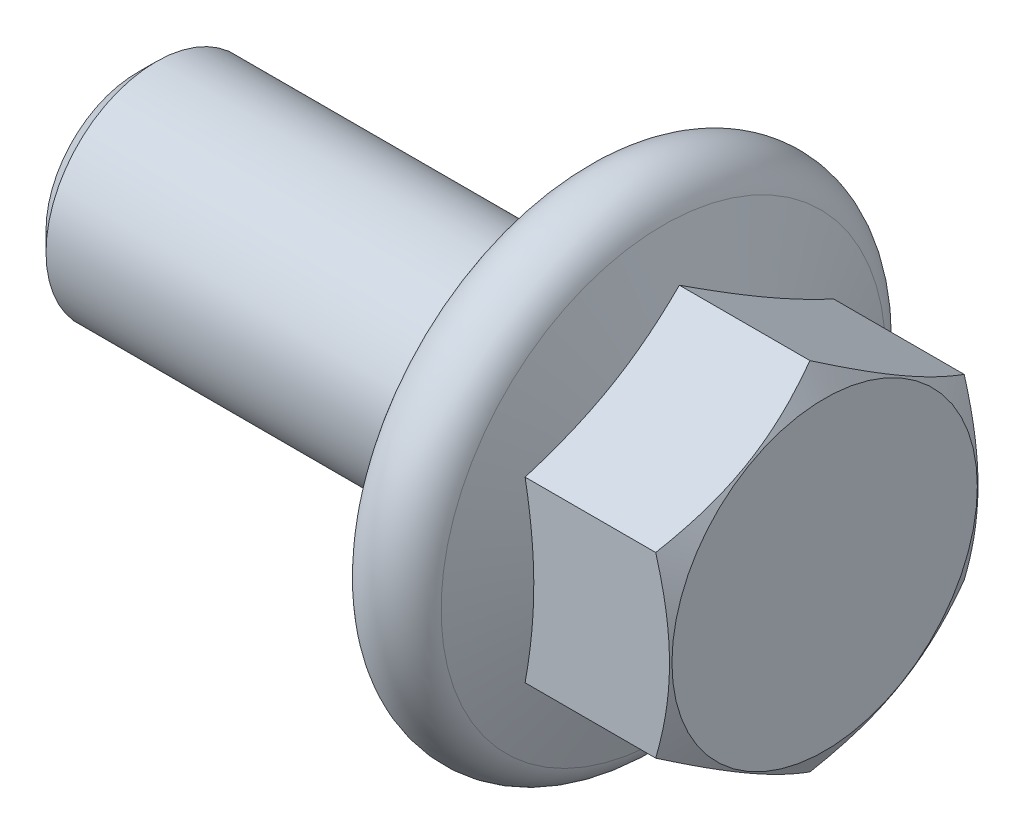
ISO-10303-21;
HEADER;
FILE_DESCRIPTION(('STEP AP214'),'2;1');
FILE_NAME('part.step','',(''),(''),'','','');
FILE_SCHEMA(('AUTOMOTIVE_DESIGN { 1 0 10303 214 1 1 1 1 }'));
ENDSEC;
DATA;
#1=APPLICATION_CONTEXT('core data for automotive mechanical design processes');
#2=APPLICATION_PROTOCOL_DEFINITION('international standard','automotive_design',2000,#1);
#3=PRODUCT_CONTEXT('',#1,'mechanical');
#4=PRODUCT('Part','Part','',(#3));
#5=PRODUCT_RELATED_PRODUCT_CATEGORY('part','',(#4));
#6=PRODUCT_DEFINITION_FORMATION('','',#4);
#7=PRODUCT_DEFINITION_CONTEXT('part definition',#1,'design');
#8=PRODUCT_DEFINITION('design','',#6,#7);
#9=PRODUCT_DEFINITION_SHAPE('','',#8);
#10=(LENGTH_UNIT() NAMED_UNIT(*) SI_UNIT(.MILLI.,.METRE.));
#11=(NAMED_UNIT(*) PLANE_ANGLE_UNIT() SI_UNIT($,.RADIAN.));
#12=(NAMED_UNIT(*) SI_UNIT($,.STERADIAN.) SOLID_ANGLE_UNIT());
#13=UNCERTAINTY_MEASURE_WITH_UNIT(LENGTH_MEASURE(1.E-05),#10,'distance_accuracy_value','');
#14=(GEOMETRIC_REPRESENTATION_CONTEXT(3) GLOBAL_UNCERTAINTY_ASSIGNED_CONTEXT((#13)) GLOBAL_UNIT_ASSIGNED_CONTEXT((#10,
#11,#12)) REPRESENTATION_CONTEXT('',''));
#15=CARTESIAN_POINT('',(0.,0.,0.));
#16=DIRECTION('',(0.,0.,1.));
#17=DIRECTION('',(1.,0.,0.));
#18=AXIS2_PLACEMENT_3D('',#15,#16,#17);
#19=CARTESIAN_POINT('',(286.686841982649,231.732577862447,52.2039636461074));
#20=DIRECTION('',(0.,-0.866025403784439,0.5));
#21=DIRECTION('',(0.,0.5,0.866025403784439));
#22=AXIS2_PLACEMENT_3D('',#19,#20,#21);
#23=PLANE('',#22);
#24=CARTESIAN_POINT('',(285.690711667062,230.722214891365,50.4539636461074));
#25=CARTESIAN_POINT('',(285.721179702552,230.805897607923,50.5989063629015));
#26=CARTESIAN_POINT('',(285.748895550176,230.889856256773,50.7443270084434));
#27=CARTESIAN_POINT('',(285.797657168736,231.05831941052,51.0361137499378));
#28=CARTESIAN_POINT('',(285.818697721353,231.142824290032,51.1824804947389));
#29=CARTESIAN_POINT('',(285.852730166642,231.311442186911,51.4745352591997));
#30=CARTESIAN_POINT('',(285.865796282362,231.395551354232,51.6202166103807));
#31=CARTESIAN_POINT('',(285.883321603825,231.563966358921,51.9119199552606));
#32=CARTESIAN_POINT('',(285.887784036244,231.648272110684,52.057941800684));
#33=CARTESIAN_POINT('',(285.887784036244,231.81688361421,52.3499854915308));
#34=CARTESIAN_POINT('',(285.883321603825,231.901189365972,52.4960073369542));
#35=CARTESIAN_POINT('',(285.865796282362,232.069604370662,52.7877106818342));
#36=CARTESIAN_POINT('',(285.852730166642,232.153713537983,52.9333920330151));
#37=CARTESIAN_POINT('',(285.818697721353,232.322331434862,53.225446797476));
#38=CARTESIAN_POINT('',(285.797657168736,232.406836314374,53.371813542277));
#39=CARTESIAN_POINT('',(285.748895550176,232.575299468121,53.6636002837714));
#40=CARTESIAN_POINT('',(285.721179702552,232.659258116971,53.8090209293133));
#41=CARTESIAN_POINT('',(285.690711667062,232.742940833529,53.9539636461074));
#42=B_SPLINE_CURVE_WITH_KNOTS('',3,(#24,#25,#26,#27,#28,#29,#30,#31,#32,#33,#34,#35,#36,#37,#38,
#39,#40,#41),.UNSPECIFIED.,.F.,.F.,(4,2,2,2,2,2,2,2,4),(0.,0.510400948319163,1.02119991788172,
1.52716902069208,2.03294833077723,2.53872764086239,3.04469674367274,3.55549571323531,
4.06589666155448),.UNSPECIFIED.);
#43=CARTESIAN_POINT('',(285.690711667062,230.722214891365,50.4539636461074));
#44=VERTEX_POINT('',#43);
#45=CARTESIAN_POINT('',(285.690711667062,232.742940833529,53.9539636461074));
#46=VERTEX_POINT('',#45);
#47=EDGE_CURVE('E41',#44,#46,#42,.T.);
#48=ORIENTED_EDGE('',*,*,#47,.F.);
#49=DIRECTION('',(1.,0.,0.));
#50=VECTOR('',#49,1.);
#51=CARTESIAN_POINT('',(284.386841982649,230.722214891365,50.4539636461074));
#52=LINE('',#51,#50);
#53=CARTESIAN_POINT('',(288.654027332057,230.722214891365,50.4539636461074));
#54=VERTEX_POINT('',#53);
#55=EDGE_CURVE('E11',#44,#54,#52,.T.);
#56=ORIENTED_EDGE('',*,*,#55,.T.);
#57=CARTESIAN_POINT('',(288.654027332057,230.722214891365,50.4539636461075));
#58=CARTESIAN_POINT('',(288.705310128086,230.811013558565,50.6077674493428));
#59=CARTESIAN_POINT('',(288.751949147132,230.900578734598,50.7628988848196));
#60=CARTESIAN_POINT('',(288.833356154107,231.081259847774,51.0758477528082));
#61=CARTESIAN_POINT('',(288.868095346466,231.172378994226,51.2336707440056));
#62=CARTESIAN_POINT('',(288.922169403902,231.353488093225,51.5473609051856));
#63=CARTESIAN_POINT('',(288.941864203763,231.443450187622,51.7031798234364));
#64=CARTESIAN_POINT('',(288.965371287829,231.623797456949,52.0155504569161));
#65=CARTESIAN_POINT('',(288.969203042603,231.714181976815,52.1721010375419));
#66=CARTESIAN_POINT('',(288.961211324287,231.883055755967,52.4645990030996));
#67=CARTESIAN_POINT('',(288.951350082929,231.961570356139,52.6005902797343));
#68=CARTESIAN_POINT('',(288.920102055801,232.118088059475,52.8716868941958));
#69=CARTESIAN_POINT('',(288.898704606212,232.196090621689,53.0067912950718));
#70=CARTESIAN_POINT('',(288.845215123715,232.352930766255,53.2784463941255));
#71=CARTESIAN_POINT('',(288.812896458175,232.431748508383,53.4149627280287));
#72=CARTESIAN_POINT('',(288.739546750589,232.588208766017,53.6859598436161));
#73=CARTESIAN_POINT('',(288.698532931741,232.665853284413,53.8204440944082));
#74=CARTESIAN_POINT('',(288.654027332057,232.742940833529,53.9539636461074));
#75=B_SPLINE_CURVE_WITH_KNOTS('',3,(#57,#58,#59,#60,#61,#62,#63,#64,#65,#66,#67,#68,#69,#70,#71,
#72,#73,#74),.UNSPECIFIED.,.F.,.F.,(4,2,2,2,2,2,2,2,4),(0.,0.554778020224562,1.11088917979757,
1.65323831076781,2.19492155557146,2.66648861960603,3.13849233914036,3.62096283935527,
4.10248645365122),.UNSPECIFIED.);
#76=CARTESIAN_POINT('',(288.654027332057,232.742940833529,53.9539636461074));
#77=VERTEX_POINT('',#76);
#78=EDGE_CURVE('E33',#54,#77,#75,.T.);
#79=ORIENTED_EDGE('',*,*,#78,.T.);
#80=DIRECTION('',(1.,0.,0.));
#81=VECTOR('',#80,1.);
#82=CARTESIAN_POINT('',(284.386841982649,232.742940833529,53.9539636461074));
#83=LINE('',#82,#81);
#84=EDGE_CURVE('E148',#46,#77,#83,.T.);
#85=ORIENTED_EDGE('',*,*,#84,.F.);
#86=EDGE_LOOP('',(#48,#56,#79,#85));
#87=FACE_BOUND('',#86,.T.);
#88=ADVANCED_FACE('F17',(#87),#23,.T.);
#89=CARTESIAN_POINT('',(286.686841982649,234.763666775693,53.9539636461074));
#90=DIRECTION('',(0.,0.,1.));
#91=DIRECTION('',(0.,1.,0.));
#92=AXIS2_PLACEMENT_3D('',#89,#90,#91);
#93=PLANE('',#92);
#94=CARTESIAN_POINT('',(285.690711667062,232.742940833529,53.9539636461074));
#95=CARTESIAN_POINT('',(285.721179702552,232.910306266645,53.9539636461074));
#96=CARTESIAN_POINT('',(285.748895550176,233.078223564344,53.9539636461074));
#97=CARTESIAN_POINT('',(285.797657168736,233.415149871839,53.9539636461074));
#98=CARTESIAN_POINT('',(285.818697721353,233.584159630862,53.9539636461074));
#99=CARTESIAN_POINT('',(285.852730166642,233.921395424621,53.9539636461074));
#100=CARTESIAN_POINT('',(285.865796282362,234.089613759262,53.9539636461074));
#101=CARTESIAN_POINT('',(285.883321603825,234.426443768641,53.9539636461074));
#102=CARTESIAN_POINT('',(285.887784036244,234.595055272167,53.9539636461074));
#103=CARTESIAN_POINT('',(285.887784036244,234.932278279218,53.9539636461074));
#104=CARTESIAN_POINT('',(285.883321603825,235.100889782743,53.9539636461074));
#105=CARTESIAN_POINT('',(285.865796282363,235.437719792123,53.9539636461074));
#106=CARTESIAN_POINT('',(285.852730166642,235.605938126764,53.9539636461074));
#107=CARTESIAN_POINT('',(285.818697721354,235.943173920523,53.9539636461074));
#108=CARTESIAN_POINT('',(285.797657168736,236.112183679545,53.9539636461074));
#109=CARTESIAN_POINT('',(285.748895550176,236.449109987041,53.9539636461074));
#110=CARTESIAN_POINT('',(285.721179702552,236.61702728474,53.9539636461074));
#111=CARTESIAN_POINT('',(285.690711667062,236.784392717856,53.9539636461074));
#112=B_SPLINE_CURVE_WITH_KNOTS('',3,(#94,#95,#96,#97,#98,#99,#100,#101,#102,#103,#104,#105,#106,
#107,#108,#109,#110,#111),.UNSPECIFIED.,.F.,.F.,(4,2,2,2,2,2,2,2,4),(0.,0.51040094831911,
1.02119991788162,1.52716902069191,2.03294833077698,2.53872764086208,3.04469674367234,
3.55549571323487,4.06589666155401),.UNSPECIFIED.);
#113=CARTESIAN_POINT('',(285.690711667062,236.784392717856,53.9539636461074));
#114=VERTEX_POINT('',#113);
#115=EDGE_CURVE('E255',#46,#114,#112,.T.);
#116=ORIENTED_EDGE('',*,*,#115,.F.);
#117=ORIENTED_EDGE('',*,*,#84,.T.);
#118=CARTESIAN_POINT('',(288.654027332057,232.742940833529,53.9539636461074));
#119=CARTESIAN_POINT('',(288.705310128086,232.92053816793,53.9539636461074));
#120=CARTESIAN_POINT('',(288.751949147132,233.099668519994,53.9539636461074));
#121=CARTESIAN_POINT('',(288.833356154107,233.461030746346,53.9539636461074));
#122=CARTESIAN_POINT('',(288.868095346466,233.64326903925,53.9539636461074));
#123=CARTESIAN_POINT('',(288.922169403902,234.005487237249,53.9539636461074));
#124=CARTESIAN_POINT('',(288.941864203763,234.185411426043,53.9539636461074));
#125=CARTESIAN_POINT('',(288.965371287829,234.546105964696,53.9539636461074));
#126=CARTESIAN_POINT('',(288.969203042603,234.726875004428,53.9539636461074));
#127=CARTESIAN_POINT('',(288.961211324287,235.064622562732,53.9539636461074));
#128=CARTESIAN_POINT('',(288.951350082929,235.221651763077,53.9539636461074));
#129=CARTESIAN_POINT('',(288.920102055801,235.534687169748,53.9539636461074));
#130=CARTESIAN_POINT('',(288.898704606213,235.690692294177,53.9539636461074));
#131=CARTESIAN_POINT('',(288.845215123716,236.004372583308,53.9539636461074));
#132=CARTESIAN_POINT('',(288.812896458176,236.162008067564,53.9539636461074));
#133=CARTESIAN_POINT('',(288.739546750589,236.474928582832,53.9539636461074));
#134=CARTESIAN_POINT('',(288.698532931741,236.630217619625,53.9539636461074));
#135=CARTESIAN_POINT('',(288.654027332058,236.784392717856,53.9539636461074));
#136=B_SPLINE_CURVE_WITH_KNOTS('',3,(#118,#119,#120,#121,#122,#123,#124,#125,#126,#127,#128,
#129,#130,#131,#132,#133,#134,#135),.UNSPECIFIED.,.F.,.F.,(4,2,2,2,2,2,2,2,4),(0.,
0.554778020224548,1.11088917979758,1.6532383107678,2.1949215555714,2.66648861960589,
3.13849233914012,3.62096283935497,4.1024864536508),.UNSPECIFIED.);
#137=CARTESIAN_POINT('',(288.654027332058,236.784392717856,53.9539636461074));
#138=VERTEX_POINT('',#137);
#139=EDGE_CURVE('E150',#77,#138,#136,.T.);
#140=ORIENTED_EDGE('',*,*,#139,.T.);
#141=DIRECTION('',(1.,0.,0.));
#142=VECTOR('',#141,1.);
#143=CARTESIAN_POINT('',(284.386841982649,236.784392717856,53.9539636461074));
#144=LINE('',#143,#142);
#145=EDGE_CURVE('E159',#114,#138,#144,.T.);
#146=ORIENTED_EDGE('',*,*,#145,.F.);
#147=EDGE_LOOP('',(#116,#117,#140,#146));
#148=FACE_BOUND('',#147,.T.);
#149=ADVANCED_FACE('F260',(#148),#93,.T.);
#150=CARTESIAN_POINT('',(286.686841982649,237.794755688938,52.2039636461074));
#151=DIRECTION('',(0.,0.866025403784439,0.5));
#152=DIRECTION('',(0.,0.5,-0.866025403784439));
#153=AXIS2_PLACEMENT_3D('',#150,#151,#152);
#154=PLANE('',#153);
#155=CARTESIAN_POINT('',(285.690711667062,236.784392717856,53.9539636461075));
#156=CARTESIAN_POINT('',(285.721179702552,236.868075434414,53.8090209293134));
#157=CARTESIAN_POINT('',(285.748895550176,236.952034083264,53.6636002837715));
#158=CARTESIAN_POINT('',(285.797657168736,237.120497237011,53.371813542277));
#159=CARTESIAN_POINT('',(285.818697721354,237.205002116523,53.225446797476));
#160=CARTESIAN_POINT('',(285.852730166643,237.373620013402,52.9333920330151));
#161=CARTESIAN_POINT('',(285.865796282363,237.457729180723,52.7877106818342));
#162=CARTESIAN_POINT('',(285.883321603825,237.626144185412,52.4960073369542));
#163=CARTESIAN_POINT('',(285.887784036245,237.710449937175,52.3499854915308));
#164=CARTESIAN_POINT('',(285.887784036245,237.879061440701,52.057941800684));
#165=CARTESIAN_POINT('',(285.883321603825,237.963367192464,51.9119199552606));
#166=CARTESIAN_POINT('',(285.865796282363,238.131782197154,51.6202166103806));
#167=CARTESIAN_POINT('',(285.852730166643,238.215891364474,51.4745352591997));
#168=CARTESIAN_POINT('',(285.818697721354,238.384509261353,51.1824804947388));
#169=CARTESIAN_POINT('',(285.797657168736,238.469014140865,51.0361137499377));
#170=CARTESIAN_POINT('',(285.748895550176,238.637477294612,50.7443270084433));
#171=CARTESIAN_POINT('',(285.721179702552,238.721435943462,50.5989063629014));
#172=CARTESIAN_POINT('',(285.690711667062,238.80511866002,50.4539636461073));
#173=B_SPLINE_CURVE_WITH_KNOTS('',3,(#155,#156,#157,#158,#159,#160,#161,#162,#163,#164,#165,
#166,#167,#168,#169,#170,#171,#172),.UNSPECIFIED.,.F.,.F.,(4,2,2,2,2,2,2,2,4),(0.,
0.510400948319236,1.02119991788184,1.5271690206922,2.03294833077738,2.53872764086256,
3.04469674367293,3.55549571323555,4.06589666155477),.UNSPECIFIED.);
#174=CARTESIAN_POINT('',(285.690711667062,238.80511866002,50.4539636461074));
#175=VERTEX_POINT('',#174);
#176=EDGE_CURVE('E228',#114,#175,#173,.T.);
#177=ORIENTED_EDGE('',*,*,#176,.F.);
#178=ORIENTED_EDGE('',*,*,#145,.T.);
#179=CARTESIAN_POINT('',(288.654027332058,236.784392717856,53.9539636461074));
#180=CARTESIAN_POINT('',(288.705310128086,236.873191385056,53.8001598428721));
#181=CARTESIAN_POINT('',(288.751949147133,236.962756561089,53.6450284073953));
#182=CARTESIAN_POINT('',(288.833356154107,237.143437674265,53.3320795394068));
#183=CARTESIAN_POINT('',(288.868095346466,237.234556820717,53.1742565482093));
#184=CARTESIAN_POINT('',(288.922169403902,237.415665919716,52.8605663870294));
#185=CARTESIAN_POINT('',(288.941864203763,237.505628014113,52.7047474687786));
#186=CARTESIAN_POINT('',(288.96537128783,237.685975283439,52.392376835299));
#187=CARTESIAN_POINT('',(288.969203042603,237.776359803306,52.2358262546733));
#188=CARTESIAN_POINT('',(288.961211324287,237.945233582458,51.9433282891155));
#189=CARTESIAN_POINT('',(288.95135008293,238.02374818263,51.8073370124808));
#190=CARTESIAN_POINT('',(288.920102055801,238.180265885966,51.5362403980191));
#191=CARTESIAN_POINT('',(288.898704606213,238.25826844818,51.4011359971432));
#192=CARTESIAN_POINT('',(288.845215123716,238.415108592746,51.1294808980894));
#193=CARTESIAN_POINT('',(288.812896458176,238.493926334874,50.9929645641861));
#194=CARTESIAN_POINT('',(288.739546750589,238.650386592508,50.7219674485988));
#195=CARTESIAN_POINT('',(288.698532931742,238.728031110904,50.5874831978066));
#196=CARTESIAN_POINT('',(288.654027332058,238.80511866002,50.4539636461074));
#197=B_SPLINE_CURVE_WITH_KNOTS('',3,(#179,#180,#181,#182,#183,#184,#185,#186,#187,#188,#189,
#190,#191,#192,#193,#194,#195,#196),.UNSPECIFIED.,.F.,.F.,(4,2,2,2,2,2,2,2,4),(0.,
0.554778020224473,1.11088917979743,1.65323831076761,2.19492155557119,2.66648861960586,
3.1384923391403,3.62096283935527,4.10248645365132),.UNSPECIFIED.);
#198=CARTESIAN_POINT('',(288.654027332058,238.80511866002,50.4539636461074));
#199=VERTEX_POINT('',#198);
#200=EDGE_CURVE('E158',#138,#199,#197,.T.);
#201=ORIENTED_EDGE('',*,*,#200,.T.);
#202=DIRECTION('',(1.,0.,0.));
#203=VECTOR('',#202,1.);
#204=CARTESIAN_POINT('',(284.386841982649,238.80511866002,50.4539636461074));
#205=LINE('',#204,#203);
#206=EDGE_CURVE('E156',#175,#199,#205,.T.);
#207=ORIENTED_EDGE('',*,*,#206,.F.);
#208=EDGE_LOOP('',(#177,#178,#201,#207));
#209=FACE_BOUND('',#208,.T.);
#210=ADVANCED_FACE('F219',(#209),#154,.T.);
#211=CARTESIAN_POINT('',(286.686841982649,237.794755688938,48.7039636461074));
#212=DIRECTION('',(0.,0.866025403784439,-0.5));
#213=DIRECTION('',(0.,-0.5,-0.866025403784439));
#214=AXIS2_PLACEMENT_3D('',#211,#212,#213);
#215=PLANE('',#214);
#216=CARTESIAN_POINT('',(285.690711667062,238.80511866002,50.4539636461075));
#217=CARTESIAN_POINT('',(285.721179702552,238.721435943462,50.3090209293134));
#218=CARTESIAN_POINT('',(285.748895550176,238.637477294612,50.1636002837715));
#219=CARTESIAN_POINT('',(285.797657168736,238.469014140865,49.8718135422771));
#220=CARTESIAN_POINT('',(285.818697721354,238.384509261353,49.725446797476));
#221=CARTESIAN_POINT('',(285.852730166643,238.215891364474,49.4333920330151));
#222=CARTESIAN_POINT('',(285.865796282363,238.131782197153,49.2877106818342));
#223=CARTESIAN_POINT('',(285.883321603825,237.963367192463,48.9960073369542));
#224=CARTESIAN_POINT('',(285.887784036245,237.879061440701,48.8499854915308));
#225=CARTESIAN_POINT('',(285.887784036245,237.710449937175,48.557941800684));
#226=CARTESIAN_POINT('',(285.883321603825,237.626144185412,48.4119199552606));
#227=CARTESIAN_POINT('',(285.865796282363,237.457729180723,48.1202166103806));
#228=CARTESIAN_POINT('',(285.852730166643,237.373620013402,47.9745352591997));
#229=CARTESIAN_POINT('',(285.818697721354,237.205002116523,47.6824804947388));
#230=CARTESIAN_POINT('',(285.797657168736,237.120497237011,47.5361137499378));
#231=CARTESIAN_POINT('',(285.748895550176,236.952034083264,47.2443270084433));
#232=CARTESIAN_POINT('',(285.721179702552,236.868075434414,47.0989063629014));
#233=CARTESIAN_POINT('',(285.690711667062,236.784392717856,46.9539636461073));
#234=B_SPLINE_CURVE_WITH_KNOTS('',3,(#216,#217,#218,#219,#220,#221,#222,#223,#224,#225,#226,
#227,#228,#229,#230,#231,#232,#233),.UNSPECIFIED.,.F.,.F.,(4,2,2,2,2,2,2,2,4),(0.,
0.510400948319223,1.02119991788184,1.52716902069223,2.0329483307774,2.53872764086255,
3.04469674367293,3.55549571323554,4.06589666155477),.UNSPECIFIED.);
#235=CARTESIAN_POINT('',(285.690711667062,236.784392717856,46.9539636461074));
#236=VERTEX_POINT('',#235);
#237=EDGE_CURVE('E64',#175,#236,#234,.T.);
#238=ORIENTED_EDGE('',*,*,#237,.F.);
#239=ORIENTED_EDGE('',*,*,#206,.T.);
#240=CARTESIAN_POINT('',(288.654027332058,238.80511866002,50.4539636461075));
#241=CARTESIAN_POINT('',(288.705310128086,238.71631999282,50.3001598428722));
#242=CARTESIAN_POINT('',(288.751949147133,238.626754816787,50.1450284073955));
#243=CARTESIAN_POINT('',(288.833356154107,238.446073703612,49.8320795394069));
#244=CARTESIAN_POINT('',(288.868095346466,238.354954557159,49.6742565482095));
#245=CARTESIAN_POINT('',(288.922169403902,238.17384545816,49.3605663870296));
#246=CARTESIAN_POINT('',(288.941864203763,238.083883363763,49.2047474687789));
#247=CARTESIAN_POINT('',(288.96537128783,237.903536094437,48.8923768352992));
#248=CARTESIAN_POINT('',(288.969203042603,237.813151574571,48.7358262546734));
#249=CARTESIAN_POINT('',(288.961211324287,237.644277795419,48.4433282891156));
#250=CARTESIAN_POINT('',(288.951350082929,237.565763195246,48.307337012481));
#251=CARTESIAN_POINT('',(288.920102055801,237.40924549191,48.0362403980194));
#252=CARTESIAN_POINT('',(288.898704606213,237.331242929696,47.9011359971434));
#253=CARTESIAN_POINT('',(288.845215123716,237.17440278513,47.6294808980896));
#254=CARTESIAN_POINT('',(288.812896458176,237.095585043002,47.4929645641863));
#255=CARTESIAN_POINT('',(288.739546750589,236.939124785368,47.2219674485989));
#256=CARTESIAN_POINT('',(288.698532931742,236.861480266972,47.0874831978066));
#257=CARTESIAN_POINT('',(288.654027332058,236.784392717856,46.9539636461074));
#258=B_SPLINE_CURVE_WITH_KNOTS('',3,(#240,#241,#242,#243,#244,#245,#246,#247,#248,#249,#250,
#251,#252,#253,#254,#255,#256,#257),.UNSPECIFIED.,.F.,.F.,(4,2,2,2,2,2,2,2,4),(0.,
0.554778020224453,1.11088917979733,1.65323831076745,2.19492155557098,2.66648861960572,
3.13849233914022,3.6209628393553,4.10248645365139),.UNSPECIFIED.);
#259=CARTESIAN_POINT('',(288.654027332058,236.784392717856,46.9539636461074));
#260=VERTEX_POINT('',#259);
#261=EDGE_CURVE('E155',#199,#260,#258,.T.);
#262=ORIENTED_EDGE('',*,*,#261,.T.);
#263=DIRECTION('',(1.,0.,0.));
#264=VECTOR('',#263,1.);
#265=CARTESIAN_POINT('',(284.386841982649,236.784392717856,46.9539636461074));
#266=LINE('',#265,#264);
#267=EDGE_CURVE('E153',#236,#260,#266,.T.);
#268=ORIENTED_EDGE('',*,*,#267,.F.);
#269=EDGE_LOOP('',(#238,#239,#262,#268));
#270=FACE_BOUND('',#269,.T.);
#271=ADVANCED_FACE('F214',(#270),#215,.T.);
#272=CARTESIAN_POINT('',(286.686841982649,234.763666775693,46.9539636461074));
#273=DIRECTION('',(0.,0.,-1.));
#274=DIRECTION('',(0.,-1.,0.));
#275=AXIS2_PLACEMENT_3D('',#272,#273,#274);
#276=PLANE('',#275);
#277=CARTESIAN_POINT('',(285.690711667062,236.784392717856,46.9539636461074));
#278=CARTESIAN_POINT('',(285.721179702552,236.61702728474,46.9539636461074));
#279=CARTESIAN_POINT('',(285.748895550176,236.449109987041,46.9539636461074));
#280=CARTESIAN_POINT('',(285.797657168736,236.112183679545,46.9539636461074));
#281=CARTESIAN_POINT('',(285.818697721354,235.943173920523,46.9539636461074));
#282=CARTESIAN_POINT('',(285.852730166642,235.605938126764,46.9539636461074));
#283=CARTESIAN_POINT('',(285.865796282363,235.437719792123,46.9539636461074));
#284=CARTESIAN_POINT('',(285.883321603825,235.100889782743,46.9539636461074));
#285=CARTESIAN_POINT('',(285.887784036244,234.932278279218,46.9539636461074));
#286=CARTESIAN_POINT('',(285.887784036244,234.595055272167,46.9539636461074));
#287=CARTESIAN_POINT('',(285.883321603825,234.426443768641,46.9539636461074));
#288=CARTESIAN_POINT('',(285.865796282362,234.089613759262,46.9539636461074));
#289=CARTESIAN_POINT('',(285.852730166642,233.921395424621,46.9539636461074));
#290=CARTESIAN_POINT('',(285.818697721353,233.584159630862,46.9539636461074));
#291=CARTESIAN_POINT('',(285.797657168736,233.415149871839,46.9539636461074));
#292=CARTESIAN_POINT('',(285.748895550176,233.078223564344,46.9539636461074));
#293=CARTESIAN_POINT('',(285.721179702552,232.910306266645,46.9539636461074));
#294=CARTESIAN_POINT('',(285.690711667062,232.742940833529,46.9539636461074));
#295=B_SPLINE_CURVE_WITH_KNOTS('',3,(#277,#278,#279,#280,#281,#282,#283,#284,#285,#286,#287,
#288,#289,#290,#291,#292,#293,#294),.UNSPECIFIED.,.F.,.F.,(4,2,2,2,2,2,2,2,4),(0.,
0.510400948319137,1.02119991788166,1.52716902069193,2.03294833077702,2.5387276408621,
3.04469674367239,3.5554957132349,4.06589666155401),.UNSPECIFIED.);
#296=CARTESIAN_POINT('',(285.690711667062,232.742940833529,46.9539636461074));
#297=VERTEX_POINT('',#296);
#298=EDGE_CURVE('E21',#236,#297,#295,.T.);
#299=ORIENTED_EDGE('',*,*,#298,.F.);
#300=ORIENTED_EDGE('',*,*,#267,.T.);
#301=CARTESIAN_POINT('',(288.654027332058,236.784392717856,46.9539636461074));
#302=CARTESIAN_POINT('',(288.705310128086,236.606795383455,46.9539636461074));
#303=CARTESIAN_POINT('',(288.751949147133,236.427665031391,46.9539636461074));
#304=CARTESIAN_POINT('',(288.833356154107,236.066302805039,46.9539636461074));
#305=CARTESIAN_POINT('',(288.868095346466,235.884064512135,46.9539636461074));
#306=CARTESIAN_POINT('',(288.922169403902,235.521846314136,46.9539636461074));
#307=CARTESIAN_POINT('',(288.941864203763,235.341922125343,46.9539636461074));
#308=CARTESIAN_POINT('',(288.965371287829,234.98122758669,46.9539636461074));
#309=CARTESIAN_POINT('',(288.969203042603,234.800458546958,46.9539636461074));
#310=CARTESIAN_POINT('',(288.961211324287,234.462710988653,46.9539636461074));
#311=CARTESIAN_POINT('',(288.951350082929,234.305681788308,46.9539636461074));
#312=CARTESIAN_POINT('',(288.920102055801,233.992646381637,46.9539636461074));
#313=CARTESIAN_POINT('',(288.898704606212,233.836641257208,46.9539636461074));
#314=CARTESIAN_POINT('',(288.845215123716,233.522960968077,46.9539636461074));
#315=CARTESIAN_POINT('',(288.812896458176,233.365325483821,46.9539636461074));
#316=CARTESIAN_POINT('',(288.739546750589,233.052404968554,46.9539636461074));
#317=CARTESIAN_POINT('',(288.698532931741,232.89711593176,46.9539636461074));
#318=CARTESIAN_POINT('',(288.654027332057,232.742940833529,46.9539636461074));
#319=B_SPLINE_CURVE_WITH_KNOTS('',3,(#301,#302,#303,#304,#305,#306,#307,#308,#309,#310,#311,
#312,#313,#314,#315,#316,#317,#318),.UNSPECIFIED.,.F.,.F.,(4,2,2,2,2,2,2,2,4),(0.,
0.554778020224399,1.1108891797973,1.65323831076737,2.19492155557083,2.66648861960547,
3.13849233913982,3.62096283935479,4.10248645365081),.UNSPECIFIED.);
#320=CARTESIAN_POINT('',(288.654027332057,232.742940833529,46.9539636461074));
#321=VERTEX_POINT('',#320);
#322=EDGE_CURVE('E152',#260,#321,#319,.T.);
#323=ORIENTED_EDGE('',*,*,#322,.T.);
#324=DIRECTION('',(1.,0.,0.));
#325=VECTOR('',#324,1.);
#326=CARTESIAN_POINT('',(284.386841982649,232.742940833529,46.9539636461074));
#327=LINE('',#326,#325);
#328=EDGE_CURVE('E73',#297,#321,#327,.T.);
#329=ORIENTED_EDGE('',*,*,#328,.F.);
#330=EDGE_LOOP('',(#299,#300,#323,#329));
#331=FACE_BOUND('',#330,.T.);
#332=ADVANCED_FACE('F211',(#331),#276,.T.);
#333=CARTESIAN_POINT('',(286.686841982649,231.732577862447,48.7039636461074));
#334=DIRECTION('',(0.,-0.866025403784439,-0.5));
#335=DIRECTION('',(0.,-0.5,0.866025403784439));
#336=AXIS2_PLACEMENT_3D('',#333,#334,#335);
#337=PLANE('',#336);
#338=CARTESIAN_POINT('',(285.690711667062,232.742940833529,46.9539636461074));
#339=CARTESIAN_POINT('',(285.721179702552,232.659258116971,47.0989063629015));
#340=CARTESIAN_POINT('',(285.748895550176,232.575299468121,47.2443270084434));
#341=CARTESIAN_POINT('',(285.797657168736,232.406836314374,47.5361137499378));
#342=CARTESIAN_POINT('',(285.818697721353,232.322331434862,47.6824804947388));
#343=CARTESIAN_POINT('',(285.852730166642,232.153713537983,47.9745352591997));
#344=CARTESIAN_POINT('',(285.865796282362,232.069604370662,48.1202166103807));
#345=CARTESIAN_POINT('',(285.883321603825,231.901189365972,48.4119199552606));
#346=CARTESIAN_POINT('',(285.887784036244,231.81688361421,48.557941800684));
#347=CARTESIAN_POINT('',(285.887784036244,231.648272110684,48.8499854915308));
#348=CARTESIAN_POINT('',(285.883321603825,231.563966358921,48.9960073369542));
#349=CARTESIAN_POINT('',(285.865796282362,231.395551354232,49.2877106818341));
#350=CARTESIAN_POINT('',(285.852730166642,231.311442186911,49.4333920330151));
#351=CARTESIAN_POINT('',(285.818697721353,231.142824290032,49.7254467974759));
#352=CARTESIAN_POINT('',(285.797657168736,231.05831941052,49.871813542277));
#353=CARTESIAN_POINT('',(285.748895550176,230.889856256773,50.1636002837714));
#354=CARTESIAN_POINT('',(285.721179702552,230.805897607923,50.3090209293133));
#355=CARTESIAN_POINT('',(285.690711667062,230.722214891365,50.4539636461074));
#356=B_SPLINE_CURVE_WITH_KNOTS('',3,(#338,#339,#340,#341,#342,#343,#344,#345,#346,#347,#348,
#349,#350,#351,#352,#353,#354,#355),.UNSPECIFIED.,.F.,.F.,(4,2,2,2,2,2,2,2,4),(0.,
0.510400948319174,1.02119991788174,1.5271690206921,2.03294833077725,2.5387276408624,
3.04469674367276,3.5554957132353,4.06589666155448),.UNSPECIFIED.);
#357=EDGE_CURVE('E121',#297,#44,#356,.T.);
#358=ORIENTED_EDGE('',*,*,#357,.F.);
#359=ORIENTED_EDGE('',*,*,#328,.T.);
#360=CARTESIAN_POINT('',(288.654027332057,232.742940833529,46.9539636461074));
#361=CARTESIAN_POINT('',(288.705310128086,232.654142166329,47.1077674493427));
#362=CARTESIAN_POINT('',(288.751949147132,232.564576990296,47.2628988848195));
#363=CARTESIAN_POINT('',(288.833356154107,232.38389587712,47.5758477528081));
#364=CARTESIAN_POINT('',(288.868095346466,232.292776730668,47.7336707440056));
#365=CARTESIAN_POINT('',(288.922169403902,232.111667631669,48.0473609051855));
#366=CARTESIAN_POINT('',(288.941864203763,232.021705537272,48.2031798234363));
#367=CARTESIAN_POINT('',(288.965371287829,231.841358267946,48.515550456916));
#368=CARTESIAN_POINT('',(288.969203042603,231.750973748079,48.6721010375418));
#369=CARTESIAN_POINT('',(288.961211324287,231.582099968927,48.9645990030996));
#370=CARTESIAN_POINT('',(288.951350082929,231.503585368755,49.1005902797342));
#371=CARTESIAN_POINT('',(288.920102055801,231.347067665419,49.3716868941958));
#372=CARTESIAN_POINT('',(288.898704606212,231.269065103205,49.5067912950717));
#373=CARTESIAN_POINT('',(288.845215123715,231.112224958639,49.7784463941254));
#374=CARTESIAN_POINT('',(288.812896458175,231.033407216511,49.9149627280287));
#375=CARTESIAN_POINT('',(288.739546750589,230.876946958877,50.185959843616));
#376=CARTESIAN_POINT('',(288.698532931741,230.799302440481,50.3204440944081));
#377=CARTESIAN_POINT('',(288.654027332057,230.722214891365,50.4539636461073));
#378=B_SPLINE_CURVE_WITH_KNOTS('',3,(#360,#361,#362,#363,#364,#365,#366,#367,#368,#369,#370,
#371,#372,#373,#374,#375,#376,#377),.UNSPECIFIED.,.F.,.F.,(4,2,2,2,2,2,2,2,4),(0.,
0.554778020224577,1.11088917979761,1.65323831076785,2.19492155557149,2.66648861960605,
3.13849233914039,3.6209628393553,4.10248645365121),.UNSPECIFIED.);
#379=EDGE_CURVE('E116',#321,#54,#378,.T.);
#380=ORIENTED_EDGE('',*,*,#379,.T.);
#381=ORIENTED_EDGE('',*,*,#55,.F.);
#382=EDGE_LOOP('',(#358,#359,#380,#381));
#383=FACE_BOUND('',#382,.T.);
#384=ADVANCED_FACE('F181',(#383),#337,.T.);
#385=CARTESIAN_POINT('',(290.987360665391,234.763666775693,50.4539636461074));
#386=DIRECTION('',(-1.,0.,0.));
#387=DIRECTION('',(0.,0.,-1.));
#388=AXIS2_PLACEMENT_3D('',#385,#386,#387);
#389=CONICAL_SURFACE('',#388,0.,1.0471975511966);
#390=ORIENTED_EDGE('',*,*,#78,.F.);
#391=ORIENTED_EDGE('',*,*,#379,.F.);
#392=ORIENTED_EDGE('',*,*,#322,.F.);
#393=ORIENTED_EDGE('',*,*,#261,.F.);
#394=ORIENTED_EDGE('',*,*,#200,.F.);
#395=ORIENTED_EDGE('',*,*,#139,.F.);
#396=EDGE_LOOP('',(#390,#391,#392,#393,#394,#395));
#397=FACE_BOUND('',#396,.T.);
#398=CARTESIAN_POINT('',(288.986841982649,234.763666775693,50.4539636461074));
#399=DIRECTION('',(1.,0.,0.));
#400=DIRECTION('',(0.,0.,-1.));
#401=AXIS2_PLACEMENT_3D('',#398,#399,#400);
#402=CIRCLE('',#401,3.465);
#403=CARTESIAN_POINT('',(288.986841982649,234.763666775693,46.9889636461074));
#404=VERTEX_POINT('',#403);
#405=EDGE_CURVE('E113',#404,#404,#402,.T.);
#406=ORIENTED_EDGE('',*,*,#405,.F.);
#407=EDGE_LOOP('',(#406));
#408=FACE_BOUND('',#407,.T.);
#409=ADVANCED_FACE('F114',(#397,#408),#389,.T.);
#410=CARTESIAN_POINT('',(288.986841982649,234.763666775693,50.4539636461074));
#411=DIRECTION('',(1.,0.,0.));
#412=DIRECTION('',(0.,0.,1.));
#413=AXIS2_PLACEMENT_3D('',#410,#411,#412);
#414=PLANE('',#413);
#415=ORIENTED_EDGE('',*,*,#405,.T.);
#416=EDGE_LOOP('',(#415));
#417=FACE_BOUND('',#416,.T.);
#418=ADVANCED_FACE('F180',(#417),#414,.T.);
#419=CARTESIAN_POINT('',(283.386841982649,234.763666775693,50.4539636461074));
#420=DIRECTION('',(-1.,0.,0.));
#421=DIRECTION('',(0.,0.,-1.));
#422=AXIS2_PLACEMENT_3D('',#419,#420,#421);
#423=PLANE('',#422);
#424=CARTESIAN_POINT('',(283.386841982649,234.763666775693,50.4539636461074));
#425=DIRECTION('',(-1.,0.,0.));
#426=DIRECTION('',(0.,0.,1.));
#427=AXIS2_PLACEMENT_3D('',#424,#425,#426);
#428=CIRCLE('',#427,3.05551918177834);
#429=CARTESIAN_POINT('',(283.386841982649,234.763666775693,53.5094828278857));
#430=VERTEX_POINT('',#429);
#431=EDGE_CURVE('E124',#430,#430,#428,.T.);
#432=ORIENTED_EDGE('',*,*,#431,.F.);
#433=EDGE_LOOP('',(#432));
#434=FACE_BOUND('',#433,.T.);
#435=CARTESIAN_POINT('',(283.386841982649,234.763666775693,50.4539636461074));
#436=DIRECTION('',(-1.,0.,0.));
#437=DIRECTION('',(0.,0.,1.));
#438=AXIS2_PLACEMENT_3D('',#435,#436,#437);
#439=CIRCLE('',#438,4.7);
#440=CARTESIAN_POINT('',(283.386841982649,234.763666775693,55.1539636461074));
#441=VERTEX_POINT('',#440);
#442=EDGE_CURVE('E117',#441,#441,#439,.T.);
#443=ORIENTED_EDGE('',*,*,#442,.T.);
#444=EDGE_LOOP('',(#443));
#445=FACE_BOUND('',#444,.T.);
#446=ADVANCED_FACE('F239',(#434,#445),#423,.T.);
#447=CARTESIAN_POINT('',(286.186841982649,234.763666775693,50.4539636461074));
#448=DIRECTION('',(-1.,0.,0.));
#449=DIRECTION('',(0.,0.,-1.));
#450=AXIS2_PLACEMENT_3D('',#447,#448,#449);
#451=CONICAL_SURFACE('',#450,2.67834504514476,1.22173047639603);
#452=ORIENTED_EDGE('',*,*,#357,.T.);
#453=ORIENTED_EDGE('',*,*,#47,.T.);
#454=ORIENTED_EDGE('',*,*,#115,.T.);
#455=ORIENTED_EDGE('',*,*,#176,.T.);
#456=ORIENTED_EDGE('',*,*,#237,.T.);
#457=ORIENTED_EDGE('',*,*,#298,.T.);
#458=EDGE_LOOP('',(#452,#453,#454,#455,#456,#457));
#459=FACE_BOUND('',#458,.T.);
#460=CARTESIAN_POINT('',(285.326534603435,234.763666775693,50.4539636461074));
#461=DIRECTION('',(1.,0.,0.));
#462=DIRECTION('',(0.,0.,-1.));
#463=AXIS2_PLACEMENT_3D('',#460,#461,#462);
#464=CIRCLE('',#463,5.04202014332566);
#465=CARTESIAN_POINT('',(285.326534603435,234.763666775693,45.4119435027817));
#466=VERTEX_POINT('',#465);
#467=EDGE_CURVE('E129',#466,#466,#464,.T.);
#468=ORIENTED_EDGE('',*,*,#467,.T.);
#469=EDGE_LOOP('',(#468));
#470=FACE_BOUND('',#469,.T.);
#471=ADVANCED_FACE('F234',(#459,#470),#451,.T.);
#472=CARTESIAN_POINT('',(284.386841982649,234.763666775693,50.4539636461074));
#473=DIRECTION('',(-1.,0.,0.));
#474=DIRECTION('',(0.,0.,-1.));
#475=AXIS2_PLACEMENT_3D('',#472,#473,#474);
#476=TOROIDAL_SURFACE('',#475,4.7,1.);
#477=ORIENTED_EDGE('',*,*,#442,.F.);
#478=EDGE_LOOP('',(#477));
#479=FACE_BOUND('',#478,.T.);
#480=ORIENTED_EDGE('',*,*,#467,.F.);
#481=EDGE_LOOP('',(#480));
#482=FACE_BOUND('',#481,.T.);
#483=ADVANCED_FACE('F238',(#479,#482),#476,.T.);
#484=CARTESIAN_POINT('',(283.436841982649,234.763666775693,50.4539636461074));
#485=DIRECTION('',(-1.,0.,0.));
#486=DIRECTION('',(0.,0.,-1.));
#487=AXIS2_PLACEMENT_3D('',#484,#485,#486);
#488=TOROIDAL_SURFACE('',#487,2.86187001446222,0.1);
#489=CARTESIAN_POINT('',(283.456303866508,234.763666775693,50.4539636461074));
#490=DIRECTION('',(1.,0.,0.));
#491=DIRECTION('',(0.,0.,1.));
#492=AXIS2_PLACEMENT_3D('',#489,#490,#491);
#493=CIRCLE('',#492,2.76378211981328);
#494=CARTESIAN_POINT('',(283.456303866508,234.763666775693,53.2177457659207));
#495=VERTEX_POINT('',#494);
#496=EDGE_CURVE('E126',#495,#495,#493,.T.);
#497=ORIENTED_EDGE('',*,*,#496,.T.);
#498=EDGE_LOOP('',(#497));
#499=FACE_BOUND('',#498,.T.);
#500=CARTESIAN_POINT('',(283.46184198265,234.763666775693,50.4539636461074));
#501=DIRECTION('',(1.,0.,0.));
#502=DIRECTION('',(0.,0.,1.));
#503=AXIS2_PLACEMENT_3D('',#500,#501,#502);
#504=CIRCLE('',#503,2.95869459812297);
#505=CARTESIAN_POINT('',(283.46184198265,234.763666775693,53.4126582442304));
#506=VERTEX_POINT('',#505);
#507=EDGE_CURVE('E127',#506,#506,#504,.T.);
#508=ORIENTED_EDGE('',*,*,#507,.F.);
#509=EDGE_LOOP('',(#508));
#510=FACE_BOUND('',#509,.T.);
#511=ADVANCED_FACE('F318',(#499,#510),#488,.F.);
#512=CARTESIAN_POINT('',(283.486841982649,234.763666775693,50.4539636461074));
#513=DIRECTION('',(-1.,0.,0.));
#514=DIRECTION('',(0.,0.,-1.));
#515=AXIS2_PLACEMENT_3D('',#512,#513,#514);
#516=TOROIDAL_SURFACE('',#515,3.05551918177834,0.1);
#517=ORIENTED_EDGE('',*,*,#431,.T.);
#518=EDGE_LOOP('',(#517));
#519=FACE_BOUND('',#518,.T.);
#520=ORIENTED_EDGE('',*,*,#507,.T.);
#521=EDGE_LOOP('',(#520));
#522=FACE_BOUND('',#521,.T.);
#523=ADVANCED_FACE('F325',(#519,#522),#516,.T.);
#524=CARTESIAN_POINT('',(273.386841982649,234.763666775693,50.4539636461074));
#525=DIRECTION('',(-1.,0.,0.));
#526=DIRECTION('',(0.,0.,-1.));
#527=AXIS2_PLACEMENT_3D('',#524,#525,#526);
#528=PLANE('',#527);
#529=CARTESIAN_POINT('',(273.386841982649,234.763666775693,50.4539636461074));
#530=DIRECTION('',(-1.,0.,0.));
#531=DIRECTION('',(0.,0.,1.));
#532=AXIS2_PLACEMENT_3D('',#529,#530,#531);
#533=CIRCLE('',#532,2.0669872984);
#534=CARTESIAN_POINT('',(273.386841982649,234.763666775693,52.5209509445074));
#535=VERTEX_POINT('',#534);
#536=EDGE_CURVE('E136',#535,#535,#533,.T.);
#537=ORIENTED_EDGE('',*,*,#536,.T.);
#538=EDGE_LOOP('',(#537));
#539=FACE_BOUND('',#538,.T.);
#540=ADVANCED_FACE('F332',(#539),#528,.T.);
#541=CARTESIAN_POINT('',(282.126841982649,234.763666775693,50.4539636461074));
#542=DIRECTION('',(-1.,0.,0.));
#543=DIRECTION('',(0.,0.,-1.));
#544=AXIS2_PLACEMENT_3D('',#541,#542,#543);
#545=CYLINDRICAL_SURFACE('',#544,2.5);
#546=CARTESIAN_POINT('',(273.819854684249,234.763666775693,50.4539636461074));
#547=DIRECTION('',(1.,0.,0.));
#548=DIRECTION('',(0.,0.,1.));
#549=AXIS2_PLACEMENT_3D('',#546,#547,#548);
#550=CIRCLE('',#549,2.5);
#551=CARTESIAN_POINT('',(273.819854684249,234.763666775693,52.9539636461074));
#552=VERTEX_POINT('',#551);
#553=EDGE_CURVE('E139',#552,#552,#550,.T.);
#554=ORIENTED_EDGE('',*,*,#553,.T.);
#555=EDGE_LOOP('',(#554));
#556=FACE_BOUND('',#555,.T.);
#557=CARTESIAN_POINT('',(281.832095795962,234.763666775693,50.4539636461074));
#558=DIRECTION('',(-1.,0.,0.));
#559=DIRECTION('',(0.,0.,-1.));
#560=AXIS2_PLACEMENT_3D('',#557,#558,#559);
#561=CIRCLE('',#560,2.5);
#562=CARTESIAN_POINT('',(281.832095795962,234.763666775693,47.9539636461074));
#563=VERTEX_POINT('',#562);
#564=EDGE_CURVE('E142',#563,#563,#561,.T.);
#565=ORIENTED_EDGE('',*,*,#564,.T.);
#566=EDGE_LOOP('',(#565));
#567=FACE_BOUND('',#566,.T.);
#568=ADVANCED_FACE('F340',(#556,#567),#545,.T.);
#569=CARTESIAN_POINT('',(282.126841982649,234.763666775693,50.4539636461074));
#570=DIRECTION('',(1.,0.,0.));
#571=DIRECTION('',(0.,0.,1.));
#572=AXIS2_PLACEMENT_3D('',#569,#570,#571);
#573=CONICAL_SURFACE('',#572,2.5,0.195868843478818);
#574=CARTESIAN_POINT('',(282.415952311729,234.763666775693,50.4539636461074));
#575=DIRECTION('',(1.,0.,0.));
#576=DIRECTION('',(0.,0.,-1.));
#577=AXIS2_PLACEMENT_3D('',#574,#575,#576);
#578=CIRCLE('',#577,2.55736316053173);
#579=CARTESIAN_POINT('',(282.415952311729,234.763666775693,47.8966004855757));
#580=VERTEX_POINT('',#579);
#581=EDGE_CURVE('E145',#580,#580,#578,.T.);
#582=ORIENTED_EDGE('',*,*,#581,.T.);
#583=EDGE_LOOP('',(#582));
#584=FACE_BOUND('',#583,.T.);
#585=ORIENTED_EDGE('',*,*,#496,.F.);
#586=EDGE_LOOP('',(#585));
#587=FACE_BOUND('',#586,.T.);
#588=ADVANCED_FACE('F348',(#584,#587),#573,.T.);
#589=CARTESIAN_POINT('',(281.832095795962,234.763666775693,50.4539636461074));
#590=DIRECTION('',(1.,0.,0.));
#591=DIRECTION('',(0.,0.,1.));
#592=AXIS2_PLACEMENT_3D('',#589,#590,#591);
#593=TOROIDAL_SURFACE('',#592,5.5,3.);
#594=ORIENTED_EDGE('',*,*,#564,.F.);
#595=EDGE_LOOP('',(#594));
#596=FACE_BOUND('',#595,.T.);
#597=ORIENTED_EDGE('',*,*,#581,.F.);
#598=EDGE_LOOP('',(#597));
#599=FACE_BOUND('',#598,.T.);
#600=ADVANCED_FACE('F356',(#596,#599),#593,.F.);
#601=CARTESIAN_POINT('',(273.819854684249,234.763666775693,50.4539636461074));
#602=DIRECTION('',(1.,0.,0.));
#603=DIRECTION('',(0.,0.,1.));
#604=AXIS2_PLACEMENT_3D('',#601,#602,#603);
#605=CONICAL_SURFACE('',#604,2.5,0.785398163397448);
#606=ORIENTED_EDGE('',*,*,#536,.F.);
#607=EDGE_LOOP('',(#606));
#608=FACE_BOUND('',#607,.T.);
#609=ORIENTED_EDGE('',*,*,#553,.F.);
#610=EDGE_LOOP('',(#609));
#611=FACE_BOUND('',#610,.T.);
#612=ADVANCED_FACE('F19',(#608,#611),#605,.T.);
#613=CLOSED_SHELL('',(#88,#149,#210,#271,#332,#384,#409,#418,#446,#471,#483,#511,#523,#540,#568,
#588,#600,#612));
#614=MANIFOLD_SOLID_BREP('B1',#613);
#615=ADVANCED_BREP_SHAPE_REPRESENTATION('',(#18,#614),#14);
#616=SHAPE_DEFINITION_REPRESENTATION(#9,#615);
ENDSEC;
END-ISO-10303-21;
